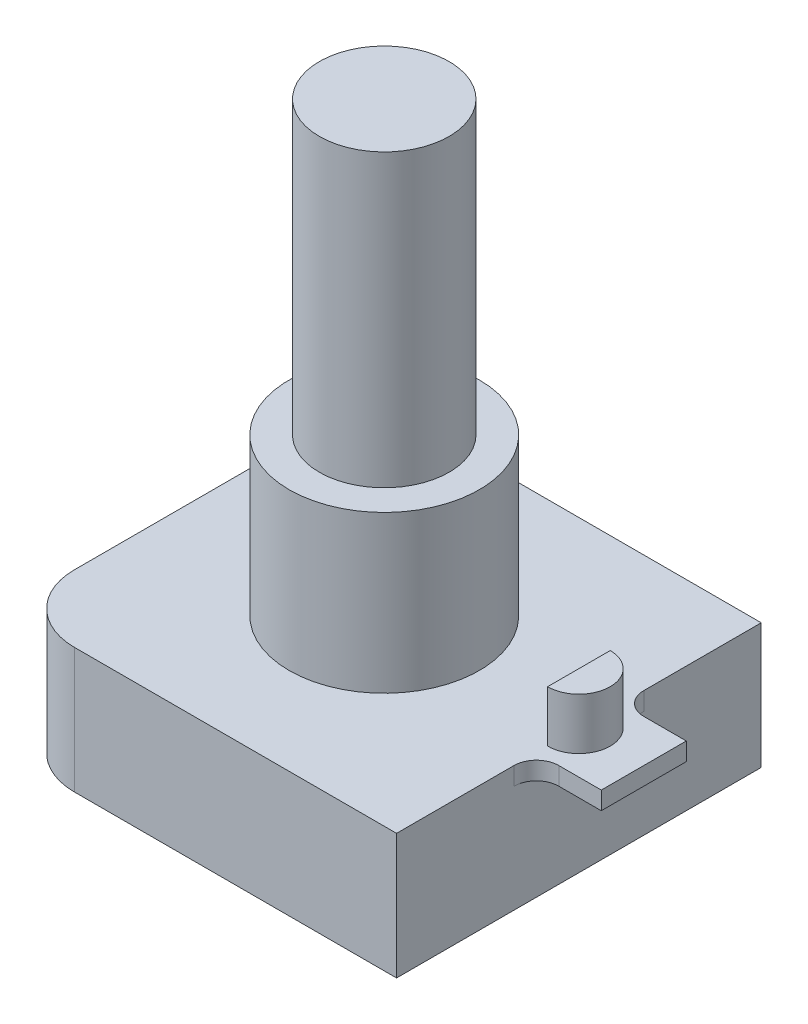
ISO-10303-21;
HEADER;
FILE_DESCRIPTION(('STEP AP214'),'2;1');
FILE_NAME('part.step','',(''),(''),'','','');
FILE_SCHEMA(('AUTOMOTIVE_DESIGN { 1 0 10303 214 1 1 1 1 }'));
ENDSEC;
DATA;
#1=APPLICATION_CONTEXT('core data for automotive mechanical design processes');
#2=APPLICATION_PROTOCOL_DEFINITION('international standard','automotive_design',2000,#1);
#3=PRODUCT_CONTEXT('',#1,'mechanical');
#4=PRODUCT('Part','Part','',(#3));
#5=PRODUCT_RELATED_PRODUCT_CATEGORY('part','',(#4));
#6=PRODUCT_DEFINITION_FORMATION('','',#4);
#7=PRODUCT_DEFINITION_CONTEXT('part definition',#1,'design');
#8=PRODUCT_DEFINITION('design','',#6,#7);
#9=PRODUCT_DEFINITION_SHAPE('','',#8);
#10=(LENGTH_UNIT() NAMED_UNIT(*) SI_UNIT(.MILLI.,.METRE.));
#11=(NAMED_UNIT(*) PLANE_ANGLE_UNIT() SI_UNIT($,.RADIAN.));
#12=(NAMED_UNIT(*) SI_UNIT($,.STERADIAN.) SOLID_ANGLE_UNIT());
#13=UNCERTAINTY_MEASURE_WITH_UNIT(LENGTH_MEASURE(1.E-05),#10,'distance_accuracy_value','');
#14=(GEOMETRIC_REPRESENTATION_CONTEXT(3) GLOBAL_UNCERTAINTY_ASSIGNED_CONTEXT((#13)) GLOBAL_UNIT_ASSIGNED_CONTEXT((#10,
#11,#12)) REPRESENTATION_CONTEXT('',''));
#15=CARTESIAN_POINT('',(0.,0.,0.));
#16=DIRECTION('',(0.,0.,1.));
#17=DIRECTION('',(1.,0.,0.));
#18=AXIS2_PLACEMENT_3D('',#15,#16,#17);
#19=CARTESIAN_POINT('',(0.,5.6,0.));
#20=DIRECTION('',(0.,1.,0.));
#21=DIRECTION('',(0.,0.,1.));
#22=AXIS2_PLACEMENT_3D('',#19,#20,#21);
#23=PLANE('',#22);
#24=CARTESIAN_POINT('',(0.,5.6,0.));
#25=DIRECTION('',(0.,1.,0.));
#26=DIRECTION('',(0.,0.,1.));
#27=AXIS2_PLACEMENT_3D('',#24,#25,#26);
#28=CIRCLE('',#27,4.25);
#29=CARTESIAN_POINT('',(0.,5.6,4.25));
#30=VERTEX_POINT('',#29);
#31=EDGE_CURVE('E181',#30,#30,#28,.T.);
#32=ORIENTED_EDGE('',*,*,#31,.F.);
#33=EDGE_LOOP('',(#32));
#34=FACE_BOUND('',#33,.T.);
#35=DIRECTION('',(-1.,0.,0.));
#36=VECTOR('',#35,1.);
#37=CARTESIAN_POINT('',(8.7,5.6,-8.15));
#38=LINE('',#37,#36);
#39=CARTESIAN_POINT('',(8.7,5.6,-8.15));
#40=VERTEX_POINT('',#39);
#41=CARTESIAN_POINT('',(-5.7,5.6,-8.15));
#42=VERTEX_POINT('',#41);
#43=EDGE_CURVE('E199',#40,#42,#38,.T.);
#44=ORIENTED_EDGE('',*,*,#43,.T.);
#45=CARTESIAN_POINT('',(-5.7,5.6,-5.15));
#46=DIRECTION('',(0.,1.,0.));
#47=DIRECTION('',(0.,0.,1.));
#48=AXIS2_PLACEMENT_3D('',#45,#46,#47);
#49=CIRCLE('',#48,3.);
#50=CARTESIAN_POINT('',(-8.7,5.6,-5.15));
#51=VERTEX_POINT('',#50);
#52=EDGE_CURVE('E229',#42,#51,#49,.T.);
#53=ORIENTED_EDGE('',*,*,#52,.T.);
#54=DIRECTION('',(0.,0.,1.));
#55=VECTOR('',#54,1.);
#56=CARTESIAN_POINT('',(-8.7,5.6,8.15));
#57=LINE('',#56,#55);
#58=CARTESIAN_POINT('',(-8.7,5.6,5.15));
#59=VERTEX_POINT('',#58);
#60=EDGE_CURVE('E190',#51,#59,#57,.T.);
#61=ORIENTED_EDGE('',*,*,#60,.T.);
#62=CARTESIAN_POINT('',(-5.7,5.6,5.15));
#63=DIRECTION('',(0.,1.,0.));
#64=DIRECTION('',(0.,0.,1.));
#65=AXIS2_PLACEMENT_3D('',#62,#63,#64);
#66=CIRCLE('',#65,3.);
#67=CARTESIAN_POINT('',(-5.7,5.6,8.15));
#68=VERTEX_POINT('',#67);
#69=EDGE_CURVE('E227',#59,#68,#66,.T.);
#70=ORIENTED_EDGE('',*,*,#69,.T.);
#71=DIRECTION('',(1.,0.,0.));
#72=VECTOR('',#71,1.);
#73=CARTESIAN_POINT('',(8.7,5.6,8.15));
#74=LINE('',#73,#72);
#75=CARTESIAN_POINT('',(8.7,5.6,8.15));
#76=VERTEX_POINT('',#75);
#77=EDGE_CURVE('E193',#68,#76,#74,.T.);
#78=ORIENTED_EDGE('',*,*,#77,.T.);
#79=DIRECTION('',(0.,0.,-1.));
#80=VECTOR('',#79,1.);
#81=CARTESIAN_POINT('',(8.7,5.6,8.15));
#82=LINE('',#81,#80);
#83=CARTESIAN_POINT('',(8.7,5.6,2.9));
#84=VERTEX_POINT('',#83);
#85=EDGE_CURVE('E197',#76,#84,#82,.T.);
#86=ORIENTED_EDGE('',*,*,#85,.T.);
#87=CARTESIAN_POINT('',(9.7,5.6,2.9));
#88=DIRECTION('',(0.,1.,0.));
#89=DIRECTION('',(0.,0.,1.));
#90=AXIS2_PLACEMENT_3D('',#87,#88,#89);
#91=CIRCLE('',#90,1.);
#92=CARTESIAN_POINT('',(9.7,5.6,1.9));
#93=VERTEX_POINT('',#92);
#94=EDGE_CURVE('E11',#84,#93,#91,.F.);
#95=ORIENTED_EDGE('',*,*,#94,.T.);
#96=DIRECTION('',(-1.,0.,0.));
#97=VECTOR('',#96,1.);
#98=CARTESIAN_POINT('',(11.6,5.6,1.9));
#99=LINE('',#98,#97);
#100=CARTESIAN_POINT('',(11.6,5.6,1.9));
#101=VERTEX_POINT('',#100);
#102=EDGE_CURVE('E172',#101,#93,#99,.T.);
#103=ORIENTED_EDGE('',*,*,#102,.F.);
#104=DIRECTION('',(0.,0.,1.));
#105=VECTOR('',#104,1.);
#106=CARTESIAN_POINT('',(11.6,5.6,1.9));
#107=LINE('',#106,#105);
#108=CARTESIAN_POINT('',(11.6,5.6,-1.9));
#109=VERTEX_POINT('',#108);
#110=EDGE_CURVE('E160',#109,#101,#107,.T.);
#111=ORIENTED_EDGE('',*,*,#110,.F.);
#112=DIRECTION('',(-1.,0.,0.));
#113=VECTOR('',#112,1.);
#114=CARTESIAN_POINT('',(11.6,5.6,-1.9));
#115=LINE('',#114,#113);
#116=CARTESIAN_POINT('',(9.7,5.6,-1.9));
#117=VERTEX_POINT('',#116);
#118=EDGE_CURVE('E174',#109,#117,#115,.T.);
#119=ORIENTED_EDGE('',*,*,#118,.T.);
#120=CARTESIAN_POINT('',(9.7,5.6,-2.9));
#121=DIRECTION('',(0.,1.,0.));
#122=DIRECTION('',(0.,0.,1.));
#123=AXIS2_PLACEMENT_3D('',#120,#121,#122);
#124=CIRCLE('',#123,1.);
#125=CARTESIAN_POINT('',(8.7,5.6,-2.9));
#126=VERTEX_POINT('',#125);
#127=EDGE_CURVE('E245',#117,#126,#124,.F.);
#128=ORIENTED_EDGE('',*,*,#127,.T.);
#129=EDGE_CURVE('E196',#126,#40,#82,.T.);
#130=ORIENTED_EDGE('',*,*,#129,.T.);
#131=EDGE_LOOP('',(#44,#53,#61,#70,#78,#86,#95,#103,#111,#119,#128,#130));
#132=FACE_BOUND('',#131,.T.);
#133=DIRECTION('',(0.,0.,1.));
#134=VECTOR('',#133,1.);
#135=CARTESIAN_POINT('',(8.7,5.6,-1.4));
#136=LINE('',#135,#134);
#137=CARTESIAN_POINT('',(8.7,5.6,-1.4));
#138=VERTEX_POINT('',#137);
#139=CARTESIAN_POINT('',(8.7,5.6,1.4));
#140=VERTEX_POINT('',#139);
#141=EDGE_CURVE('E148',#138,#140,#136,.T.);
#142=ORIENTED_EDGE('',*,*,#141,.F.);
#143=CARTESIAN_POINT('',(8.7,5.6,0.));
#144=DIRECTION('',(0.,1.,0.));
#145=DIRECTION('',(0.,0.,1.));
#146=AXIS2_PLACEMENT_3D('',#143,#144,#145);
#147=CIRCLE('',#146,1.4);
#148=EDGE_CURVE('E50',#140,#138,#147,.T.);
#149=ORIENTED_EDGE('',*,*,#148,.F.);
#150=EDGE_LOOP('',(#142,#149));
#151=FACE_BOUND('',#150,.T.);
#152=ADVANCED_FACE('F35',(#34,#132,#151),#23,.T.);
#153=CARTESIAN_POINT('',(8.7,5.6,8.15));
#154=DIRECTION('',(-1.,0.,0.));
#155=DIRECTION('',(0.,0.,1.));
#156=AXIS2_PLACEMENT_3D('',#153,#154,#155);
#157=PLANE('',#156);
#158=ORIENTED_EDGE('',*,*,#129,.F.);
#159=DIRECTION('',(0.,1.,0.));
#160=VECTOR('',#159,1.);
#161=CARTESIAN_POINT('',(8.7,4.8,-2.9));
#162=LINE('',#161,#160);
#163=CARTESIAN_POINT('',(8.7,4.8,-2.9));
#164=VERTEX_POINT('',#163);
#165=EDGE_CURVE('E239',#126,#164,#162,.F.);
#166=ORIENTED_EDGE('',*,*,#165,.T.);
#167=DIRECTION('',(0.,0.,-1.));
#168=VECTOR('',#167,1.);
#169=CARTESIAN_POINT('',(8.7,4.8,1.9));
#170=LINE('',#169,#168);
#171=CARTESIAN_POINT('',(8.7,4.8,2.9));
#172=VERTEX_POINT('',#171);
#173=EDGE_CURVE('E151',#172,#164,#170,.T.);
#174=ORIENTED_EDGE('',*,*,#173,.F.);
#175=DIRECTION('',(0.,-1.,0.));
#176=VECTOR('',#175,1.);
#177=CARTESIAN_POINT('',(8.7,5.6,2.9));
#178=LINE('',#177,#176);
#179=EDGE_CURVE('E237',#172,#84,#178,.F.);
#180=ORIENTED_EDGE('',*,*,#179,.T.);
#181=ORIENTED_EDGE('',*,*,#85,.F.);
#182=DIRECTION('',(0.,-1.,0.));
#183=VECTOR('',#182,1.);
#184=CARTESIAN_POINT('',(8.7,5.6,8.15));
#185=LINE('',#184,#183);
#186=CARTESIAN_POINT('',(8.7,0.,8.15));
#187=VERTEX_POINT('',#186);
#188=EDGE_CURVE('E213',#76,#187,#185,.T.);
#189=ORIENTED_EDGE('',*,*,#188,.T.);
#190=DIRECTION('',(0.,0.,-1.));
#191=VECTOR('',#190,1.);
#192=CARTESIAN_POINT('',(8.7,0.,8.15));
#193=LINE('',#192,#191);
#194=CARTESIAN_POINT('',(8.7,0.,-8.15));
#195=VERTEX_POINT('',#194);
#196=EDGE_CURVE('E207',#187,#195,#193,.T.);
#197=ORIENTED_EDGE('',*,*,#196,.T.);
#198=DIRECTION('',(0.,-1.,0.));
#199=VECTOR('',#198,1.);
#200=CARTESIAN_POINT('',(8.7,5.6,-8.15));
#201=LINE('',#200,#199);
#202=EDGE_CURVE('E202',#40,#195,#201,.T.);
#203=ORIENTED_EDGE('',*,*,#202,.F.);
#204=EDGE_LOOP('',(#158,#166,#174,#180,#181,#189,#197,#203));
#205=FACE_BOUND('',#204,.T.);
#206=ADVANCED_FACE('F259',(#205),#157,.F.);
#207=CARTESIAN_POINT('',(-8.7,5.6,8.15));
#208=DIRECTION('',(1.,0.,0.));
#209=DIRECTION('',(0.,0.,-1.));
#210=AXIS2_PLACEMENT_3D('',#207,#208,#209);
#211=PLANE('',#210);
#212=ORIENTED_EDGE('',*,*,#60,.F.);
#213=DIRECTION('',(0.,-1.,0.));
#214=VECTOR('',#213,1.);
#215=CARTESIAN_POINT('',(-8.7,5.6,-5.15));
#216=LINE('',#215,#214);
#217=CARTESIAN_POINT('',(-8.7,0.,-5.15));
#218=VERTEX_POINT('',#217);
#219=EDGE_CURVE('E218',#51,#218,#216,.T.);
#220=ORIENTED_EDGE('',*,*,#219,.T.);
#221=DIRECTION('',(0.,0.,1.));
#222=VECTOR('',#221,1.);
#223=CARTESIAN_POINT('',(-8.7,0.,8.15));
#224=LINE('',#223,#222);
#225=CARTESIAN_POINT('',(-8.7,0.,5.15));
#226=VERTEX_POINT('',#225);
#227=EDGE_CURVE('E187',#218,#226,#224,.T.);
#228=ORIENTED_EDGE('',*,*,#227,.T.);
#229=DIRECTION('',(0.,-1.,0.));
#230=VECTOR('',#229,1.);
#231=CARTESIAN_POINT('',(-8.7,5.6,5.15));
#232=LINE('',#231,#230);
#233=EDGE_CURVE('E216',#226,#59,#232,.F.);
#234=ORIENTED_EDGE('',*,*,#233,.T.);
#235=EDGE_LOOP('',(#212,#220,#228,#234));
#236=FACE_BOUND('',#235,.T.);
#237=ADVANCED_FACE('F284',(#236),#211,.F.);
#238=CARTESIAN_POINT('',(8.7,5.6,8.15));
#239=DIRECTION('',(0.,0.,-1.));
#240=DIRECTION('',(-1.,0.,0.));
#241=AXIS2_PLACEMENT_3D('',#238,#239,#240);
#242=PLANE('',#241);
#243=ORIENTED_EDGE('',*,*,#77,.F.);
#244=DIRECTION('',(0.,-1.,0.));
#245=VECTOR('',#244,1.);
#246=CARTESIAN_POINT('',(-5.7,5.6,8.15));
#247=LINE('',#246,#245);
#248=CARTESIAN_POINT('',(-5.7,0.,8.15));
#249=VERTEX_POINT('',#248);
#250=EDGE_CURVE('E231',#68,#249,#247,.T.);
#251=ORIENTED_EDGE('',*,*,#250,.T.);
#252=DIRECTION('',(1.,0.,0.));
#253=VECTOR('',#252,1.);
#254=CARTESIAN_POINT('',(8.7,0.,8.15));
#255=LINE('',#254,#253);
#256=EDGE_CURVE('E205',#249,#187,#255,.T.);
#257=ORIENTED_EDGE('',*,*,#256,.T.);
#258=ORIENTED_EDGE('',*,*,#188,.F.);
#259=EDGE_LOOP('',(#243,#251,#257,#258));
#260=FACE_BOUND('',#259,.T.);
#261=ADVANCED_FACE('F266',(#260),#242,.F.);
#262=CARTESIAN_POINT('',(8.7,5.6,-8.15));
#263=DIRECTION('',(0.,0.,1.));
#264=DIRECTION('',(1.,0.,0.));
#265=AXIS2_PLACEMENT_3D('',#262,#263,#264);
#266=PLANE('',#265);
#267=DIRECTION('',(-1.,0.,0.));
#268=VECTOR('',#267,1.);
#269=CARTESIAN_POINT('',(8.7,0.,-8.15));
#270=LINE('',#269,#268);
#271=CARTESIAN_POINT('',(-5.7,0.,-8.15));
#272=VERTEX_POINT('',#271);
#273=EDGE_CURVE('E194',#195,#272,#270,.T.);
#274=ORIENTED_EDGE('',*,*,#273,.T.);
#275=DIRECTION('',(0.,-1.,0.));
#276=VECTOR('',#275,1.);
#277=CARTESIAN_POINT('',(-5.7,5.6,-8.15));
#278=LINE('',#277,#276);
#279=EDGE_CURVE('E225',#272,#42,#278,.F.);
#280=ORIENTED_EDGE('',*,*,#279,.T.);
#281=ORIENTED_EDGE('',*,*,#43,.F.);
#282=ORIENTED_EDGE('',*,*,#202,.T.);
#283=EDGE_LOOP('',(#274,#280,#281,#282));
#284=FACE_BOUND('',#283,.T.);
#285=ADVANCED_FACE('F276',(#284),#266,.F.);
#286=CARTESIAN_POINT('',(0.,0.,0.));
#287=DIRECTION('',(0.,1.,0.));
#288=DIRECTION('',(0.,0.,1.));
#289=AXIS2_PLACEMENT_3D('',#286,#287,#288);
#290=PLANE('',#289);
#291=ORIENTED_EDGE('',*,*,#227,.F.);
#292=CARTESIAN_POINT('',(-5.7,0.,-5.15));
#293=DIRECTION('',(0.,1.,0.));
#294=DIRECTION('',(0.,0.,1.));
#295=AXIS2_PLACEMENT_3D('',#292,#293,#294);
#296=CIRCLE('',#295,3.);
#297=EDGE_CURVE('E223',#218,#272,#296,.F.);
#298=ORIENTED_EDGE('',*,*,#297,.T.);
#299=ORIENTED_EDGE('',*,*,#273,.F.);
#300=ORIENTED_EDGE('',*,*,#196,.F.);
#301=ORIENTED_EDGE('',*,*,#256,.F.);
#302=CARTESIAN_POINT('',(-5.7,0.,5.15));
#303=DIRECTION('',(0.,1.,0.));
#304=DIRECTION('',(0.,0.,1.));
#305=AXIS2_PLACEMENT_3D('',#302,#303,#304);
#306=CIRCLE('',#305,3.);
#307=EDGE_CURVE('E221',#249,#226,#306,.F.);
#308=ORIENTED_EDGE('',*,*,#307,.T.);
#309=EDGE_LOOP('',(#291,#298,#299,#300,#301,#308));
#310=FACE_BOUND('',#309,.T.);
#311=ADVANCED_FACE('F273',(#310),#290,.F.);
#312=CARTESIAN_POINT('',(0.,12.6,0.));
#313=DIRECTION('',(0.,-1.,0.));
#314=DIRECTION('',(0.,0.,-1.));
#315=AXIS2_PLACEMENT_3D('',#312,#313,#314);
#316=CYLINDRICAL_SURFACE('',#315,4.25);
#317=CARTESIAN_POINT('',(0.,12.6,0.));
#318=DIRECTION('',(0.,1.,0.));
#319=DIRECTION('',(0.,0.,1.));
#320=AXIS2_PLACEMENT_3D('',#317,#318,#319);
#321=CIRCLE('',#320,4.25);
#322=CARTESIAN_POINT('',(0.,12.6,4.25));
#323=VERTEX_POINT('',#322);
#324=EDGE_CURVE('E184',#323,#323,#321,.T.);
#325=ORIENTED_EDGE('',*,*,#324,.F.);
#326=EDGE_LOOP('',(#325));
#327=FACE_BOUND('',#326,.T.);
#328=ORIENTED_EDGE('',*,*,#31,.T.);
#329=EDGE_LOOP('',(#328));
#330=FACE_BOUND('',#329,.T.);
#331=ADVANCED_FACE('F310',(#327,#330),#316,.T.);
#332=CARTESIAN_POINT('',(0.,12.6,0.));
#333=DIRECTION('',(0.,1.,0.));
#334=DIRECTION('',(0.,0.,1.));
#335=AXIS2_PLACEMENT_3D('',#332,#333,#334);
#336=PLANE('',#335);
#337=CARTESIAN_POINT('',(0.,12.6,0.));
#338=DIRECTION('',(0.,1.,0.));
#339=DIRECTION('',(0.,0.,1.));
#340=AXIS2_PLACEMENT_3D('',#337,#338,#339);
#341=CIRCLE('',#340,2.9);
#342=CARTESIAN_POINT('',(0.,12.6,2.9));
#343=VERTEX_POINT('',#342);
#344=EDGE_CURVE('E177',#343,#343,#341,.T.);
#345=ORIENTED_EDGE('',*,*,#344,.F.);
#346=EDGE_LOOP('',(#345));
#347=FACE_BOUND('',#346,.T.);
#348=ORIENTED_EDGE('',*,*,#324,.T.);
#349=EDGE_LOOP('',(#348));
#350=FACE_BOUND('',#349,.T.);
#351=ADVANCED_FACE('F343',(#347,#350),#336,.T.);
#352=CARTESIAN_POINT('',(0.,25.6,0.));
#353=DIRECTION('',(0.,-1.,0.));
#354=DIRECTION('',(0.,0.,-1.));
#355=AXIS2_PLACEMENT_3D('',#352,#353,#354);
#356=CYLINDRICAL_SURFACE('',#355,2.9);
#357=CARTESIAN_POINT('',(0.,25.6,0.));
#358=DIRECTION('',(0.,1.,0.));
#359=DIRECTION('',(0.,0.,1.));
#360=AXIS2_PLACEMENT_3D('',#357,#358,#359);
#361=CIRCLE('',#360,2.9);
#362=CARTESIAN_POINT('',(0.,25.6,2.9));
#363=VERTEX_POINT('',#362);
#364=EDGE_CURVE('E178',#363,#363,#361,.T.);
#365=ORIENTED_EDGE('',*,*,#364,.F.);
#366=EDGE_LOOP('',(#365));
#367=FACE_BOUND('',#366,.T.);
#368=ORIENTED_EDGE('',*,*,#344,.T.);
#369=EDGE_LOOP('',(#368));
#370=FACE_BOUND('',#369,.T.);
#371=ADVANCED_FACE('F350',(#367,#370),#356,.T.);
#372=CARTESIAN_POINT('',(0.,25.6,0.));
#373=DIRECTION('',(0.,1.,0.));
#374=DIRECTION('',(0.,0.,1.));
#375=AXIS2_PLACEMENT_3D('',#372,#373,#374);
#376=PLANE('',#375);
#377=ORIENTED_EDGE('',*,*,#364,.T.);
#378=EDGE_LOOP('',(#377));
#379=FACE_BOUND('',#378,.T.);
#380=ADVANCED_FACE('F298',(#379),#376,.T.);
#381=CARTESIAN_POINT('',(-5.7,5.6,-5.15));
#382=DIRECTION('',(0.,-1.,0.));
#383=DIRECTION('',(0.,0.,-1.));
#384=AXIS2_PLACEMENT_3D('',#381,#382,#383);
#385=CYLINDRICAL_SURFACE('',#384,3.);
#386=ORIENTED_EDGE('',*,*,#52,.F.);
#387=ORIENTED_EDGE('',*,*,#279,.F.);
#388=ORIENTED_EDGE('',*,*,#297,.F.);
#389=ORIENTED_EDGE('',*,*,#219,.F.);
#390=EDGE_LOOP('',(#386,#387,#388,#389));
#391=FACE_BOUND('',#390,.T.);
#392=ADVANCED_FACE('F280',(#391),#385,.T.);
#393=CARTESIAN_POINT('',(-5.7,5.6,5.15));
#394=DIRECTION('',(0.,-1.,0.));
#395=DIRECTION('',(0.,0.,-1.));
#396=AXIS2_PLACEMENT_3D('',#393,#394,#395);
#397=CYLINDRICAL_SURFACE('',#396,3.);
#398=ORIENTED_EDGE('',*,*,#69,.F.);
#399=ORIENTED_EDGE('',*,*,#233,.F.);
#400=ORIENTED_EDGE('',*,*,#307,.F.);
#401=ORIENTED_EDGE('',*,*,#250,.F.);
#402=EDGE_LOOP('',(#398,#399,#400,#401));
#403=FACE_BOUND('',#402,.T.);
#404=ADVANCED_FACE('F287',(#403),#397,.T.);
#405=CARTESIAN_POINT('',(11.6,4.8,-1.9));
#406=DIRECTION('',(0.,0.,1.));
#407=DIRECTION('',(1.,0.,0.));
#408=AXIS2_PLACEMENT_3D('',#405,#406,#407);
#409=PLANE('',#408);
#410=DIRECTION('',(-1.,0.,0.));
#411=VECTOR('',#410,1.);
#412=CARTESIAN_POINT('',(11.6,4.8,-1.9));
#413=LINE('',#412,#411);
#414=CARTESIAN_POINT('',(11.6,4.8,-1.9));
#415=VERTEX_POINT('',#414);
#416=CARTESIAN_POINT('',(9.7,4.8,-1.9));
#417=VERTEX_POINT('',#416);
#418=EDGE_CURVE('E165',#415,#417,#413,.T.);
#419=ORIENTED_EDGE('',*,*,#418,.T.);
#420=DIRECTION('',(0.,1.,0.));
#421=VECTOR('',#420,1.);
#422=CARTESIAN_POINT('',(9.7,5.6,-1.9));
#423=LINE('',#422,#421);
#424=EDGE_CURVE('E234',#417,#117,#423,.T.);
#425=ORIENTED_EDGE('',*,*,#424,.T.);
#426=ORIENTED_EDGE('',*,*,#118,.F.);
#427=DIRECTION('',(0.,1.,0.));
#428=VECTOR('',#427,1.);
#429=CARTESIAN_POINT('',(11.6,4.8,-1.9));
#430=LINE('',#429,#428);
#431=EDGE_CURVE('E153',#415,#109,#430,.T.);
#432=ORIENTED_EDGE('',*,*,#431,.F.);
#433=EDGE_LOOP('',(#419,#425,#426,#432));
#434=FACE_BOUND('',#433,.T.);
#435=ADVANCED_FACE('F289',(#434),#409,.F.);
#436=CARTESIAN_POINT('',(11.6,4.8,1.9));
#437=DIRECTION('',(0.,0.,-1.));
#438=DIRECTION('',(-1.,0.,0.));
#439=AXIS2_PLACEMENT_3D('',#436,#437,#438);
#440=PLANE('',#439);
#441=ORIENTED_EDGE('',*,*,#102,.T.);
#442=DIRECTION('',(0.,-1.,0.));
#443=VECTOR('',#442,1.);
#444=CARTESIAN_POINT('',(9.7,4.8,1.9));
#445=LINE('',#444,#443);
#446=CARTESIAN_POINT('',(9.7,4.8,1.9));
#447=VERTEX_POINT('',#446);
#448=EDGE_CURVE('E242',#93,#447,#445,.T.);
#449=ORIENTED_EDGE('',*,*,#448,.T.);
#450=DIRECTION('',(-1.,0.,0.));
#451=VECTOR('',#450,1.);
#452=CARTESIAN_POINT('',(11.6,4.8,1.9));
#453=LINE('',#452,#451);
#454=CARTESIAN_POINT('',(11.6,4.8,1.9));
#455=VERTEX_POINT('',#454);
#456=EDGE_CURVE('E169',#455,#447,#453,.T.);
#457=ORIENTED_EDGE('',*,*,#456,.F.);
#458=DIRECTION('',(0.,-1.,0.));
#459=VECTOR('',#458,1.);
#460=CARTESIAN_POINT('',(11.6,4.8,1.9));
#461=LINE('',#460,#459);
#462=EDGE_CURVE('E162',#101,#455,#461,.T.);
#463=ORIENTED_EDGE('',*,*,#462,.F.);
#464=EDGE_LOOP('',(#441,#449,#457,#463));
#465=FACE_BOUND('',#464,.T.);
#466=ADVANCED_FACE('F295',(#465),#440,.F.);
#467=CARTESIAN_POINT('',(11.6,4.8,1.9));
#468=DIRECTION('',(0.,1.,0.));
#469=DIRECTION('',(0.,0.,1.));
#470=AXIS2_PLACEMENT_3D('',#467,#468,#469);
#471=PLANE('',#470);
#472=ORIENTED_EDGE('',*,*,#173,.T.);
#473=CARTESIAN_POINT('',(9.7,4.8,-2.9));
#474=DIRECTION('',(0.,1.,0.));
#475=DIRECTION('',(0.,0.,1.));
#476=AXIS2_PLACEMENT_3D('',#473,#474,#475);
#477=CIRCLE('',#476,1.);
#478=EDGE_CURVE('E247',#164,#417,#477,.T.);
#479=ORIENTED_EDGE('',*,*,#478,.T.);
#480=ORIENTED_EDGE('',*,*,#418,.F.);
#481=DIRECTION('',(0.,0.,-1.));
#482=VECTOR('',#481,1.);
#483=CARTESIAN_POINT('',(11.6,4.8,1.9));
#484=LINE('',#483,#482);
#485=EDGE_CURVE('E164',#455,#415,#484,.T.);
#486=ORIENTED_EDGE('',*,*,#485,.F.);
#487=ORIENTED_EDGE('',*,*,#456,.T.);
#488=CARTESIAN_POINT('',(9.7,4.8,2.9));
#489=DIRECTION('',(0.,1.,0.));
#490=DIRECTION('',(0.,0.,1.));
#491=AXIS2_PLACEMENT_3D('',#488,#489,#490);
#492=CIRCLE('',#491,1.);
#493=EDGE_CURVE('E43',#447,#172,#492,.T.);
#494=ORIENTED_EDGE('',*,*,#493,.T.);
#495=EDGE_LOOP('',(#472,#479,#480,#486,#487,#494));
#496=FACE_BOUND('',#495,.T.);
#497=ADVANCED_FACE('F251',(#496),#471,.F.);
#498=CARTESIAN_POINT('',(11.6,0.,0.));
#499=DIRECTION('',(-1.,0.,0.));
#500=DIRECTION('',(0.,0.,1.));
#501=AXIS2_PLACEMENT_3D('',#498,#499,#500);
#502=PLANE('',#501);
#503=ORIENTED_EDGE('',*,*,#431,.T.);
#504=ORIENTED_EDGE('',*,*,#110,.T.);
#505=ORIENTED_EDGE('',*,*,#462,.T.);
#506=ORIENTED_EDGE('',*,*,#485,.T.);
#507=EDGE_LOOP('',(#503,#504,#505,#506));
#508=FACE_BOUND('',#507,.T.);
#509=ADVANCED_FACE('F377',(#508),#502,.F.);
#510=CARTESIAN_POINT('',(9.7,4.8,-2.9));
#511=DIRECTION('',(0.,-1.,0.));
#512=DIRECTION('',(0.,0.,-1.));
#513=AXIS2_PLACEMENT_3D('',#510,#511,#512);
#514=CYLINDRICAL_SURFACE('',#513,1.);
#515=ORIENTED_EDGE('',*,*,#478,.F.);
#516=ORIENTED_EDGE('',*,*,#165,.F.);
#517=ORIENTED_EDGE('',*,*,#127,.F.);
#518=ORIENTED_EDGE('',*,*,#424,.F.);
#519=EDGE_LOOP('',(#515,#516,#517,#518));
#520=FACE_BOUND('',#519,.T.);
#521=ADVANCED_FACE('F381',(#520),#514,.F.);
#522=CARTESIAN_POINT('',(9.7,4.8,2.9));
#523=DIRECTION('',(0.,1.,0.));
#524=DIRECTION('',(0.,0.,1.));
#525=AXIS2_PLACEMENT_3D('',#522,#523,#524);
#526=CYLINDRICAL_SURFACE('',#525,1.);
#527=ORIENTED_EDGE('',*,*,#94,.F.);
#528=ORIENTED_EDGE('',*,*,#179,.F.);
#529=ORIENTED_EDGE('',*,*,#493,.F.);
#530=ORIENTED_EDGE('',*,*,#448,.F.);
#531=EDGE_LOOP('',(#527,#528,#529,#530));
#532=FACE_BOUND('',#531,.T.);
#533=ADVANCED_FACE('F37',(#532),#526,.F.);
#534=CARTESIAN_POINT('',(8.7,7.9,0.));
#535=DIRECTION('',(0.,-1.,0.));
#536=DIRECTION('',(0.,0.,-1.));
#537=AXIS2_PLACEMENT_3D('',#534,#535,#536);
#538=CYLINDRICAL_SURFACE('',#537,1.4);
#539=ORIENTED_EDGE('',*,*,#148,.T.);
#540=DIRECTION('',(0.,-1.,0.));
#541=VECTOR('',#540,1.);
#542=CARTESIAN_POINT('',(8.7,7.9,-1.4));
#543=LINE('',#542,#541);
#544=CARTESIAN_POINT('',(8.7,7.9,-1.4));
#545=VERTEX_POINT('',#544);
#546=EDGE_CURVE('E140',#545,#138,#543,.T.);
#547=ORIENTED_EDGE('',*,*,#546,.F.);
#548=CARTESIAN_POINT('',(8.7,7.9,0.));
#549=DIRECTION('',(0.,1.,0.));
#550=DIRECTION('',(0.,0.,1.));
#551=AXIS2_PLACEMENT_3D('',#548,#549,#550);
#552=CIRCLE('',#551,1.4);
#553=CARTESIAN_POINT('',(8.7,7.9,1.4));
#554=VERTEX_POINT('',#553);
#555=EDGE_CURVE('E145',#554,#545,#552,.T.);
#556=ORIENTED_EDGE('',*,*,#555,.F.);
#557=DIRECTION('',(0.,-1.,0.));
#558=VECTOR('',#557,1.);
#559=CARTESIAN_POINT('',(8.7,7.9,1.4));
#560=LINE('',#559,#558);
#561=EDGE_CURVE('E142',#554,#140,#560,.T.);
#562=ORIENTED_EDGE('',*,*,#561,.T.);
#563=EDGE_LOOP('',(#539,#547,#556,#562));
#564=FACE_BOUND('',#563,.T.);
#565=ADVANCED_FACE('F150',(#564),#538,.T.);
#566=CARTESIAN_POINT('',(8.7,7.9,-1.4));
#567=DIRECTION('',(1.,0.,0.));
#568=DIRECTION('',(0.,0.,-1.));
#569=AXIS2_PLACEMENT_3D('',#566,#567,#568);
#570=PLANE('',#569);
#571=ORIENTED_EDGE('',*,*,#141,.T.);
#572=ORIENTED_EDGE('',*,*,#561,.F.);
#573=DIRECTION('',(0.,0.,1.));
#574=VECTOR('',#573,1.);
#575=CARTESIAN_POINT('',(8.7,7.9,-1.4));
#576=LINE('',#575,#574);
#577=EDGE_CURVE('E137',#545,#554,#576,.T.);
#578=ORIENTED_EDGE('',*,*,#577,.F.);
#579=ORIENTED_EDGE('',*,*,#546,.T.);
#580=EDGE_LOOP('',(#571,#572,#578,#579));
#581=FACE_BOUND('',#580,.T.);
#582=ADVANCED_FACE('F139',(#581),#570,.F.);
#583=CARTESIAN_POINT('',(8.7,7.9,0.));
#584=DIRECTION('',(0.,1.,0.));
#585=DIRECTION('',(0.,0.,1.));
#586=AXIS2_PLACEMENT_3D('',#583,#584,#585);
#587=PLANE('',#586);
#588=ORIENTED_EDGE('',*,*,#555,.T.);
#589=ORIENTED_EDGE('',*,*,#577,.T.);
#590=EDGE_LOOP('',(#588,#589));
#591=FACE_BOUND('',#590,.T.);
#592=ADVANCED_FACE('F147',(#591),#587,.T.);
#593=CLOSED_SHELL('',(#152,#206,#237,#261,#285,#311,#331,#351,#371,#380,#392,#404,#435,#466,
#497,#509,#521,#533,#565,#582,#592));
#594=MANIFOLD_SOLID_BREP('B2',#593);
#595=ADVANCED_BREP_SHAPE_REPRESENTATION('',(#18,#594),#14);
#596=SHAPE_DEFINITION_REPRESENTATION(#9,#595);
ENDSEC;
END-ISO-10303-21;
